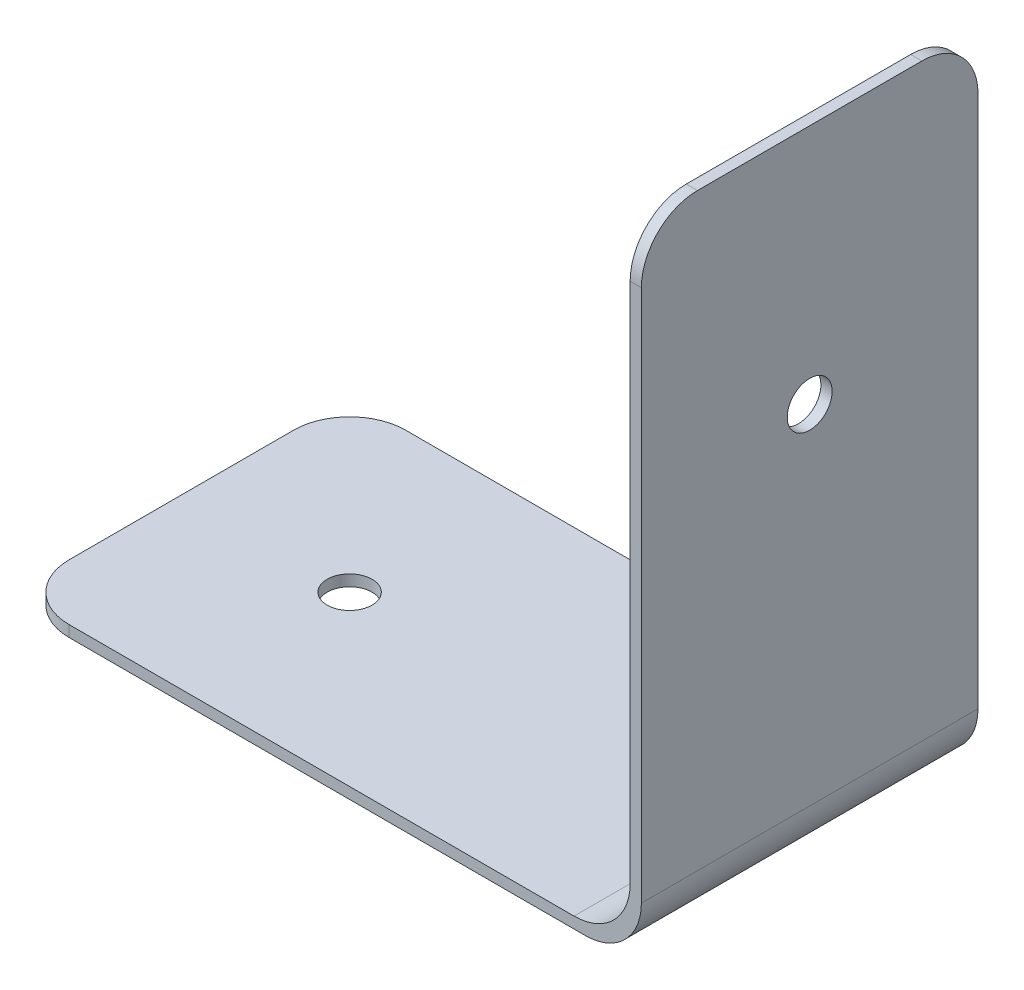
ISO-10303-21;
HEADER;
FILE_DESCRIPTION(('STEP AP214'),'2;1');
FILE_NAME('part.step','',(''),(''),'','','');
FILE_SCHEMA(('AUTOMOTIVE_DESIGN { 1 0 10303 214 1 1 1 1 }'));
ENDSEC;
DATA;
#1=APPLICATION_CONTEXT('core data for automotive mechanical design processes');
#2=APPLICATION_PROTOCOL_DEFINITION('international standard','automotive_design',2000,#1);
#3=PRODUCT_CONTEXT('',#1,'mechanical');
#4=PRODUCT('Part','Part','',(#3));
#5=PRODUCT_RELATED_PRODUCT_CATEGORY('part','',(#4));
#6=PRODUCT_DEFINITION_FORMATION('','',#4);
#7=PRODUCT_DEFINITION_CONTEXT('part definition',#1,'design');
#8=PRODUCT_DEFINITION('design','',#6,#7);
#9=PRODUCT_DEFINITION_SHAPE('','',#8);
#10=(LENGTH_UNIT() NAMED_UNIT(*) SI_UNIT(.MILLI.,.METRE.));
#11=(NAMED_UNIT(*) PLANE_ANGLE_UNIT() SI_UNIT($,.RADIAN.));
#12=(NAMED_UNIT(*) SI_UNIT($,.STERADIAN.) SOLID_ANGLE_UNIT());
#13=UNCERTAINTY_MEASURE_WITH_UNIT(LENGTH_MEASURE(1.E-05),#10,'distance_accuracy_value','');
#14=(GEOMETRIC_REPRESENTATION_CONTEXT(3) GLOBAL_UNCERTAINTY_ASSIGNED_CONTEXT((#13)) GLOBAL_UNIT_ASSIGNED_CONTEXT((#10,
#11,#12)) REPRESENTATION_CONTEXT('',''));
#15=CARTESIAN_POINT('',(0.,0.,0.));
#16=DIRECTION('',(0.,0.,1.));
#17=DIRECTION('',(1.,0.,0.));
#18=AXIS2_PLACEMENT_3D('',#15,#16,#17);
#19=CARTESIAN_POINT('',(0.,0.,60.));
#20=DIRECTION('',(1.,0.,0.));
#21=DIRECTION('',(0.,0.,-1.));
#22=AXIS2_PLACEMENT_3D('',#19,#20,#21);
#23=PLANE('',#22);
#24=DIRECTION('',(0.,0.,-1.));
#25=VECTOR('',#24,1.);
#26=CARTESIAN_POINT('',(0.,2.,60.));
#27=LINE('',#26,#25);
#28=CARTESIAN_POINT('',(0.,2.,50.));
#29=VERTEX_POINT('',#28);
#30=CARTESIAN_POINT('',(0.,2.,10.));
#31=VERTEX_POINT('',#30);
#32=EDGE_CURVE('E162',#29,#31,#27,.T.);
#33=ORIENTED_EDGE('',*,*,#32,.T.);
#34=DIRECTION('',(0.,-1.,0.));
#35=VECTOR('',#34,1.);
#36=CARTESIAN_POINT('',(0.,0.,10.));
#37=LINE('',#36,#35);
#38=CARTESIAN_POINT('',(0.,0.,10.));
#39=VERTEX_POINT('',#38);
#40=EDGE_CURVE('E211',#31,#39,#37,.T.);
#41=ORIENTED_EDGE('',*,*,#40,.T.);
#42=DIRECTION('',(0.,0.,-1.));
#43=VECTOR('',#42,1.);
#44=CARTESIAN_POINT('',(0.,0.,60.));
#45=LINE('',#44,#43);
#46=CARTESIAN_POINT('',(0.,0.,50.));
#47=VERTEX_POINT('',#46);
#48=EDGE_CURVE('E145',#47,#39,#45,.T.);
#49=ORIENTED_EDGE('',*,*,#48,.F.);
#50=DIRECTION('',(0.,-1.,0.));
#51=VECTOR('',#50,1.);
#52=CARTESIAN_POINT('',(0.,2.,50.));
#53=LINE('',#52,#51);
#54=EDGE_CURVE('E209',#47,#29,#53,.F.);
#55=ORIENTED_EDGE('',*,*,#54,.T.);
#56=EDGE_LOOP('',(#33,#41,#49,#55));
#57=FACE_BOUND('',#56,.T.);
#58=ADVANCED_FACE('F35',(#57),#23,.F.);
#59=CARTESIAN_POINT('',(0.,0.,60.));
#60=DIRECTION('',(0.,1.,0.));
#61=DIRECTION('',(-1.,0.,0.));
#62=AXIS2_PLACEMENT_3D('',#59,#60,#61);
#63=PLANE('',#62);
#64=CARTESIAN_POINT('',(30.,0.,30.));
#65=DIRECTION('',(0.,1.,0.));
#66=DIRECTION('',(-1.,0.,0.));
#67=AXIS2_PLACEMENT_3D('',#64,#65,#66);
#68=CIRCLE('',#67,4.00000000000001);
#69=CARTESIAN_POINT('',(26.,0.,30.));
#70=VERTEX_POINT('',#69);
#71=EDGE_CURVE('E165',#70,#70,#68,.T.);
#72=ORIENTED_EDGE('',*,*,#71,.T.);
#73=EDGE_LOOP('',(#72));
#74=FACE_BOUND('',#73,.T.);
#75=ORIENTED_EDGE('',*,*,#48,.T.);
#76=CARTESIAN_POINT('',(10.,0.,10.));
#77=DIRECTION('',(0.,1.,0.));
#78=DIRECTION('',(-1.,0.,0.));
#79=AXIS2_PLACEMENT_3D('',#76,#77,#78);
#80=CIRCLE('',#79,10.);
#81=CARTESIAN_POINT('',(10.,0.,0.));
#82=VERTEX_POINT('',#81);
#83=EDGE_CURVE('E216',#39,#82,#80,.F.);
#84=ORIENTED_EDGE('',*,*,#83,.T.);
#85=DIRECTION('',(1.,0.,0.));
#86=VECTOR('',#85,1.);
#87=CARTESIAN_POINT('',(0.,0.,0.));
#88=LINE('',#87,#86);
#89=CARTESIAN_POINT('',(102.,0.,0.));
#90=VERTEX_POINT('',#89);
#91=EDGE_CURVE('E142',#82,#90,#88,.T.);
#92=ORIENTED_EDGE('',*,*,#91,.T.);
#93=DIRECTION('',(0.,0.,-1.));
#94=VECTOR('',#93,1.);
#95=CARTESIAN_POINT('',(102.,0.,60.));
#96=LINE('',#95,#94);
#97=CARTESIAN_POINT('',(102.,0.,60.));
#98=VERTEX_POINT('',#97);
#99=EDGE_CURVE('E139',#98,#90,#96,.T.);
#100=ORIENTED_EDGE('',*,*,#99,.F.);
#101=DIRECTION('',(1.,0.,0.));
#102=VECTOR('',#101,1.);
#103=CARTESIAN_POINT('',(0.,0.,60.));
#104=LINE('',#103,#102);
#105=CARTESIAN_POINT('',(9.99999999999999,0.,60.));
#106=VERTEX_POINT('',#105);
#107=EDGE_CURVE('E127',#106,#98,#104,.T.);
#108=ORIENTED_EDGE('',*,*,#107,.F.);
#109=CARTESIAN_POINT('',(9.99999999999999,0.,50.));
#110=DIRECTION('',(0.,1.,0.));
#111=DIRECTION('',(-1.,0.,0.));
#112=AXIS2_PLACEMENT_3D('',#109,#110,#111);
#113=CIRCLE('',#112,10.);
#114=EDGE_CURVE('E214',#106,#47,#113,.F.);
#115=ORIENTED_EDGE('',*,*,#114,.T.);
#116=EDGE_LOOP('',(#75,#84,#92,#100,#108,#115));
#117=FACE_BOUND('',#116,.T.);
#118=ADVANCED_FACE('F141',(#74,#117),#63,.F.);
#119=CARTESIAN_POINT('',(102.,10.,60.));
#120=DIRECTION('',(0.,0.,-1.));
#121=DIRECTION('',(-1.,0.,0.));
#122=AXIS2_PLACEMENT_3D('',#119,#120,#121);
#123=CYLINDRICAL_SURFACE('',#122,9.99999999999999);
#124=CARTESIAN_POINT('',(102.,10.,0.));
#125=DIRECTION('',(0.,0.,1.));
#126=DIRECTION('',(1.,0.,0.));
#127=AXIS2_PLACEMENT_3D('',#124,#125,#126);
#128=CIRCLE('',#127,9.99999999999999);
#129=CARTESIAN_POINT('',(112.,10.,0.));
#130=VERTEX_POINT('',#129);
#131=EDGE_CURVE('E164',#90,#130,#128,.T.);
#132=ORIENTED_EDGE('',*,*,#131,.T.);
#133=DIRECTION('',(0.,0.,-1.));
#134=VECTOR('',#133,1.);
#135=CARTESIAN_POINT('',(112.,10.,60.));
#136=LINE('',#135,#134);
#137=CARTESIAN_POINT('',(112.,10.,60.));
#138=VERTEX_POINT('',#137);
#139=EDGE_CURVE('E146',#138,#130,#136,.T.);
#140=ORIENTED_EDGE('',*,*,#139,.F.);
#141=CARTESIAN_POINT('',(102.,10.,60.));
#142=DIRECTION('',(0.,0.,1.));
#143=DIRECTION('',(1.,0.,0.));
#144=AXIS2_PLACEMENT_3D('',#141,#142,#143);
#145=CIRCLE('',#144,9.99999999999999);
#146=EDGE_CURVE('E132',#98,#138,#145,.T.);
#147=ORIENTED_EDGE('',*,*,#146,.F.);
#148=ORIENTED_EDGE('',*,*,#99,.T.);
#149=EDGE_LOOP('',(#132,#140,#147,#148));
#150=FACE_BOUND('',#149,.T.);
#151=ADVANCED_FACE('F148',(#150),#123,.T.);
#152=CARTESIAN_POINT('',(112.,10.,60.));
#153=DIRECTION('',(-1.,0.,0.));
#154=DIRECTION('',(0.,0.,1.));
#155=AXIS2_PLACEMENT_3D('',#152,#153,#154);
#156=PLANE('',#155);
#157=CARTESIAN_POINT('',(112.,72.,30.));
#158=DIRECTION('',(-1.,0.,0.));
#159=DIRECTION('',(0.,-1.,0.));
#160=AXIS2_PLACEMENT_3D('',#157,#158,#159);
#161=CIRCLE('',#160,4.00000000000001);
#162=CARTESIAN_POINT('',(112.,68.,30.));
#163=VERTEX_POINT('',#162);
#164=EDGE_CURVE('E385',#163,#163,#161,.T.);
#165=ORIENTED_EDGE('',*,*,#164,.T.);
#166=EDGE_LOOP('',(#165));
#167=FACE_BOUND('',#166,.T.);
#168=DIRECTION('',(0.,1.,0.));
#169=VECTOR('',#168,1.);
#170=CARTESIAN_POINT('',(112.,10.,0.));
#171=LINE('',#170,#169);
#172=CARTESIAN_POINT('',(112.,105.,0.));
#173=VERTEX_POINT('',#172);
#174=EDGE_CURVE('E167',#130,#173,#171,.T.);
#175=ORIENTED_EDGE('',*,*,#174,.T.);
#176=CARTESIAN_POINT('',(112.,105.,10.));
#177=DIRECTION('',(-1.,0.,0.));
#178=DIRECTION('',(0.,0.,1.));
#179=AXIS2_PLACEMENT_3D('',#176,#177,#178);
#180=CIRCLE('',#179,10.);
#181=CARTESIAN_POINT('',(112.,115.,10.));
#182=VERTEX_POINT('',#181);
#183=EDGE_CURVE('E204',#173,#182,#180,.F.);
#184=ORIENTED_EDGE('',*,*,#183,.T.);
#185=DIRECTION('',(0.,0.,-1.));
#186=VECTOR('',#185,1.);
#187=CARTESIAN_POINT('',(112.,115.,60.));
#188=LINE('',#187,#186);
#189=CARTESIAN_POINT('',(112.,115.,50.));
#190=VERTEX_POINT('',#189);
#191=EDGE_CURVE('E186',#190,#182,#188,.T.);
#192=ORIENTED_EDGE('',*,*,#191,.F.);
#193=CARTESIAN_POINT('',(112.,105.,50.));
#194=DIRECTION('',(-1.,0.,0.));
#195=DIRECTION('',(0.,0.,1.));
#196=AXIS2_PLACEMENT_3D('',#193,#194,#195);
#197=CIRCLE('',#196,10.);
#198=CARTESIAN_POINT('',(112.,105.,60.));
#199=VERTEX_POINT('',#198);
#200=EDGE_CURVE('E202',#190,#199,#197,.F.);
#201=ORIENTED_EDGE('',*,*,#200,.T.);
#202=DIRECTION('',(0.,1.,0.));
#203=VECTOR('',#202,1.);
#204=CARTESIAN_POINT('',(112.,10.,60.));
#205=LINE('',#204,#203);
#206=EDGE_CURVE('E151',#138,#199,#205,.T.);
#207=ORIENTED_EDGE('',*,*,#206,.F.);
#208=ORIENTED_EDGE('',*,*,#139,.T.);
#209=EDGE_LOOP('',(#175,#184,#192,#201,#207,#208));
#210=FACE_BOUND('',#209,.T.);
#211=ADVANCED_FACE('F230',(#167,#210),#156,.F.);
#212=CARTESIAN_POINT('',(112.,115.,60.));
#213=DIRECTION('',(0.,-1.,0.));
#214=DIRECTION('',(0.,0.,-1.));
#215=AXIS2_PLACEMENT_3D('',#212,#213,#214);
#216=PLANE('',#215);
#217=ORIENTED_EDGE('',*,*,#191,.T.);
#218=DIRECTION('',(-1.,0.,0.));
#219=VECTOR('',#218,1.);
#220=CARTESIAN_POINT('',(112.,115.,10.));
#221=LINE('',#220,#219);
#222=CARTESIAN_POINT('',(110.,115.,10.));
#223=VERTEX_POINT('',#222);
#224=EDGE_CURVE('E193',#182,#223,#221,.T.);
#225=ORIENTED_EDGE('',*,*,#224,.T.);
#226=DIRECTION('',(0.,0.,-1.));
#227=VECTOR('',#226,1.);
#228=CARTESIAN_POINT('',(110.,115.,60.));
#229=LINE('',#228,#227);
#230=CARTESIAN_POINT('',(110.,115.,50.));
#231=VERTEX_POINT('',#230);
#232=EDGE_CURVE('E183',#231,#223,#229,.T.);
#233=ORIENTED_EDGE('',*,*,#232,.F.);
#234=DIRECTION('',(-1.,0.,0.));
#235=VECTOR('',#234,1.);
#236=CARTESIAN_POINT('',(112.,115.,50.));
#237=LINE('',#236,#235);
#238=EDGE_CURVE('E191',#231,#190,#237,.F.);
#239=ORIENTED_EDGE('',*,*,#238,.T.);
#240=EDGE_LOOP('',(#217,#225,#233,#239));
#241=FACE_BOUND('',#240,.T.);
#242=ADVANCED_FACE('F244',(#241),#216,.F.);
#243=CARTESIAN_POINT('',(110.,115.,60.));
#244=DIRECTION('',(1.,0.,0.));
#245=DIRECTION('',(0.,1.,0.));
#246=AXIS2_PLACEMENT_3D('',#243,#244,#245);
#247=PLANE('',#246);
#248=CARTESIAN_POINT('',(110.,72.,30.));
#249=DIRECTION('',(-1.,0.,0.));
#250=DIRECTION('',(0.,-1.,0.));
#251=AXIS2_PLACEMENT_3D('',#248,#249,#250);
#252=CIRCLE('',#251,4.00000000000001);
#253=CARTESIAN_POINT('',(110.,68.,30.));
#254=VERTEX_POINT('',#253);
#255=EDGE_CURVE('E388',#254,#254,#252,.T.);
#256=ORIENTED_EDGE('',*,*,#255,.F.);
#257=EDGE_LOOP('',(#256));
#258=FACE_BOUND('',#257,.T.);
#259=ORIENTED_EDGE('',*,*,#232,.T.);
#260=CARTESIAN_POINT('',(110.,105.,10.));
#261=DIRECTION('',(1.,0.,0.));
#262=DIRECTION('',(0.,1.,0.));
#263=AXIS2_PLACEMENT_3D('',#260,#261,#262);
#264=CIRCLE('',#263,10.);
#265=CARTESIAN_POINT('',(110.,105.,0.));
#266=VERTEX_POINT('',#265);
#267=EDGE_CURVE('E198',#223,#266,#264,.F.);
#268=ORIENTED_EDGE('',*,*,#267,.T.);
#269=DIRECTION('',(0.,-1.,0.));
#270=VECTOR('',#269,1.);
#271=CARTESIAN_POINT('',(110.,115.,0.));
#272=LINE('',#271,#270);
#273=CARTESIAN_POINT('',(110.,12.,0.));
#274=VERTEX_POINT('',#273);
#275=EDGE_CURVE('E170',#266,#274,#272,.T.);
#276=ORIENTED_EDGE('',*,*,#275,.T.);
#277=DIRECTION('',(0.,0.,-1.));
#278=VECTOR('',#277,1.);
#279=CARTESIAN_POINT('',(110.,12.,60.));
#280=LINE('',#279,#278);
#281=CARTESIAN_POINT('',(110.,12.,60.));
#282=VERTEX_POINT('',#281);
#283=EDGE_CURVE('E180',#282,#274,#280,.T.);
#284=ORIENTED_EDGE('',*,*,#283,.F.);
#285=DIRECTION('',(0.,-1.,0.));
#286=VECTOR('',#285,1.);
#287=CARTESIAN_POINT('',(110.,115.,60.));
#288=LINE('',#287,#286);
#289=CARTESIAN_POINT('',(110.,105.,60.));
#290=VERTEX_POINT('',#289);
#291=EDGE_CURVE('E153',#290,#282,#288,.T.);
#292=ORIENTED_EDGE('',*,*,#291,.F.);
#293=CARTESIAN_POINT('',(110.,105.,50.));
#294=DIRECTION('',(1.,0.,0.));
#295=DIRECTION('',(0.,1.,0.));
#296=AXIS2_PLACEMENT_3D('',#293,#294,#295);
#297=CIRCLE('',#296,10.);
#298=EDGE_CURVE('E196',#290,#231,#297,.F.);
#299=ORIENTED_EDGE('',*,*,#298,.T.);
#300=EDGE_LOOP('',(#259,#268,#276,#284,#292,#299));
#301=FACE_BOUND('',#300,.T.);
#302=ADVANCED_FACE('F241',(#258,#301),#247,.F.);
#303=CARTESIAN_POINT('',(100.,12.,60.));
#304=DIRECTION('',(0.,0.,-1.));
#305=DIRECTION('',(-1.,0.,0.));
#306=AXIS2_PLACEMENT_3D('',#303,#304,#305);
#307=CYLINDRICAL_SURFACE('',#306,10.);
#308=CARTESIAN_POINT('',(100.,12.,0.));
#309=DIRECTION('',(0.,0.,-1.));
#310=DIRECTION('',(1.,0.,0.));
#311=AXIS2_PLACEMENT_3D('',#308,#309,#310);
#312=CIRCLE('',#311,10.);
#313=CARTESIAN_POINT('',(100.,2.,0.));
#314=VERTEX_POINT('',#313);
#315=EDGE_CURVE('E172',#274,#314,#312,.T.);
#316=ORIENTED_EDGE('',*,*,#315,.T.);
#317=DIRECTION('',(0.,0.,-1.));
#318=VECTOR('',#317,1.);
#319=CARTESIAN_POINT('',(100.,2.,60.));
#320=LINE('',#319,#318);
#321=CARTESIAN_POINT('',(100.,2.,60.));
#322=VERTEX_POINT('',#321);
#323=EDGE_CURVE('E177',#322,#314,#320,.T.);
#324=ORIENTED_EDGE('',*,*,#323,.F.);
#325=CARTESIAN_POINT('',(100.,12.,60.));
#326=DIRECTION('',(0.,0.,-1.));
#327=DIRECTION('',(1.,0.,0.));
#328=AXIS2_PLACEMENT_3D('',#325,#326,#327);
#329=CIRCLE('',#328,10.);
#330=EDGE_CURVE('E158',#282,#322,#329,.T.);
#331=ORIENTED_EDGE('',*,*,#330,.F.);
#332=ORIENTED_EDGE('',*,*,#283,.T.);
#333=EDGE_LOOP('',(#316,#324,#331,#332));
#334=FACE_BOUND('',#333,.T.);
#335=ADVANCED_FACE('F253',(#334),#307,.F.);
#336=CARTESIAN_POINT('',(0.,2.,60.));
#337=DIRECTION('',(0.,-1.,0.));
#338=DIRECTION('',(1.,0.,0.));
#339=AXIS2_PLACEMENT_3D('',#336,#337,#338);
#340=PLANE('',#339);
#341=CARTESIAN_POINT('',(30.,2.,30.));
#342=DIRECTION('',(0.,1.,0.));
#343=DIRECTION('',(-1.,0.,0.));
#344=AXIS2_PLACEMENT_3D('',#341,#342,#343);
#345=CIRCLE('',#344,4.00000000000001);
#346=CARTESIAN_POINT('',(26.,2.,30.));
#347=VERTEX_POINT('',#346);
#348=EDGE_CURVE('E390',#347,#347,#345,.T.);
#349=ORIENTED_EDGE('',*,*,#348,.F.);
#350=EDGE_LOOP('',(#349));
#351=FACE_BOUND('',#350,.T.);
#352=DIRECTION('',(-1.,0.,0.));
#353=VECTOR('',#352,1.);
#354=CARTESIAN_POINT('',(0.,2.,0.));
#355=LINE('',#354,#353);
#356=CARTESIAN_POINT('',(10.,2.,0.));
#357=VERTEX_POINT('',#356);
#358=EDGE_CURVE('E136',#314,#357,#355,.T.);
#359=ORIENTED_EDGE('',*,*,#358,.T.);
#360=CARTESIAN_POINT('',(10.,2.,10.));
#361=DIRECTION('',(0.,-1.,0.));
#362=DIRECTION('',(1.,0.,0.));
#363=AXIS2_PLACEMENT_3D('',#360,#361,#362);
#364=CIRCLE('',#363,10.);
#365=EDGE_CURVE('E43',#357,#31,#364,.F.);
#366=ORIENTED_EDGE('',*,*,#365,.T.);
#367=ORIENTED_EDGE('',*,*,#32,.F.);
#368=CARTESIAN_POINT('',(9.99999999999999,2.,50.));
#369=DIRECTION('',(0.,-1.,0.));
#370=DIRECTION('',(1.,0.,0.));
#371=AXIS2_PLACEMENT_3D('',#368,#369,#370);
#372=CIRCLE('',#371,10.);
#373=CARTESIAN_POINT('',(9.99999999999999,2.,60.));
#374=VERTEX_POINT('',#373);
#375=EDGE_CURVE('E50',#29,#374,#372,.F.);
#376=ORIENTED_EDGE('',*,*,#375,.T.);
#377=DIRECTION('',(-1.,0.,0.));
#378=VECTOR('',#377,1.);
#379=CARTESIAN_POINT('',(0.,2.,60.));
#380=LINE('',#379,#378);
#381=EDGE_CURVE('E160',#322,#374,#380,.T.);
#382=ORIENTED_EDGE('',*,*,#381,.F.);
#383=ORIENTED_EDGE('',*,*,#323,.T.);
#384=EDGE_LOOP('',(#359,#366,#367,#376,#382,#383));
#385=FACE_BOUND('',#384,.T.);
#386=ADVANCED_FACE('F220',(#351,#385),#340,.F.);
#387=CARTESIAN_POINT('',(100.,12.,60.));
#388=DIRECTION('',(0.,0.,1.));
#389=DIRECTION('',(1.,0.,0.));
#390=AXIS2_PLACEMENT_3D('',#387,#388,#389);
#391=PLANE('',#390);
#392=ORIENTED_EDGE('',*,*,#381,.T.);
#393=DIRECTION('',(0.,-1.,0.));
#394=VECTOR('',#393,1.);
#395=CARTESIAN_POINT('',(9.99999999999999,0.,60.));
#396=LINE('',#395,#394);
#397=EDGE_CURVE('E11',#374,#106,#396,.T.);
#398=ORIENTED_EDGE('',*,*,#397,.T.);
#399=ORIENTED_EDGE('',*,*,#107,.T.);
#400=ORIENTED_EDGE('',*,*,#146,.T.);
#401=ORIENTED_EDGE('',*,*,#206,.T.);
#402=DIRECTION('',(-1.,0.,0.));
#403=VECTOR('',#402,1.);
#404=CARTESIAN_POINT('',(110.,105.,60.));
#405=LINE('',#404,#403);
#406=EDGE_CURVE('E206',#199,#290,#405,.T.);
#407=ORIENTED_EDGE('',*,*,#406,.T.);
#408=ORIENTED_EDGE('',*,*,#291,.T.);
#409=ORIENTED_EDGE('',*,*,#330,.T.);
#410=EDGE_LOOP('',(#392,#398,#399,#400,#401,#407,#408,#409));
#411=FACE_BOUND('',#410,.T.);
#412=ADVANCED_FACE('F129',(#411),#391,.T.);
#413=CARTESIAN_POINT('',(100.,12.,0.));
#414=DIRECTION('',(0.,0.,1.));
#415=DIRECTION('',(1.,0.,0.));
#416=AXIS2_PLACEMENT_3D('',#413,#414,#415);
#417=PLANE('',#416);
#418=ORIENTED_EDGE('',*,*,#91,.F.);
#419=DIRECTION('',(0.,-1.,0.));
#420=VECTOR('',#419,1.);
#421=CARTESIAN_POINT('',(9.99999999999999,12.,0.));
#422=LINE('',#421,#420);
#423=EDGE_CURVE('E58',#82,#357,#422,.F.);
#424=ORIENTED_EDGE('',*,*,#423,.T.);
#425=ORIENTED_EDGE('',*,*,#358,.F.);
#426=ORIENTED_EDGE('',*,*,#315,.F.);
#427=ORIENTED_EDGE('',*,*,#275,.F.);
#428=DIRECTION('',(-1.,0.,0.));
#429=VECTOR('',#428,1.);
#430=CARTESIAN_POINT('',(100.,105.,0.));
#431=LINE('',#430,#429);
#432=EDGE_CURVE('E200',#266,#173,#431,.F.);
#433=ORIENTED_EDGE('',*,*,#432,.T.);
#434=ORIENTED_EDGE('',*,*,#174,.F.);
#435=ORIENTED_EDGE('',*,*,#131,.F.);
#436=EDGE_LOOP('',(#418,#424,#425,#426,#427,#433,#434,#435));
#437=FACE_BOUND('',#436,.T.);
#438=ADVANCED_FACE('F227',(#437),#417,.F.);
#439=CARTESIAN_POINT('',(30.,0.,30.));
#440=DIRECTION('',(0.,1.,0.));
#441=DIRECTION('',(-1.,0.,0.));
#442=AXIS2_PLACEMENT_3D('',#439,#440,#441);
#443=CYLINDRICAL_SURFACE('',#442,4.00000000000001);
#444=ORIENTED_EDGE('',*,*,#71,.F.);
#445=EDGE_LOOP('',(#444));
#446=FACE_BOUND('',#445,.T.);
#447=ORIENTED_EDGE('',*,*,#348,.T.);
#448=EDGE_LOOP('',(#447));
#449=FACE_BOUND('',#448,.T.);
#450=ADVANCED_FACE('F295',(#446,#449),#443,.F.);
#451=CARTESIAN_POINT('',(112.,72.,30.));
#452=DIRECTION('',(-1.,0.,0.));
#453=DIRECTION('',(0.,-1.,0.));
#454=AXIS2_PLACEMENT_3D('',#451,#452,#453);
#455=CYLINDRICAL_SURFACE('',#454,4.00000000000001);
#456=ORIENTED_EDGE('',*,*,#164,.F.);
#457=EDGE_LOOP('',(#456));
#458=FACE_BOUND('',#457,.T.);
#459=ORIENTED_EDGE('',*,*,#255,.T.);
#460=EDGE_LOOP('',(#459));
#461=FACE_BOUND('',#460,.T.);
#462=ADVANCED_FACE('F271',(#458,#461),#455,.F.);
#463=CARTESIAN_POINT('',(112.,105.,10.));
#464=DIRECTION('',(-1.,0.,0.));
#465=DIRECTION('',(0.,0.,1.));
#466=AXIS2_PLACEMENT_3D('',#463,#464,#465);
#467=CYLINDRICAL_SURFACE('',#466,10.);
#468=ORIENTED_EDGE('',*,*,#183,.F.);
#469=ORIENTED_EDGE('',*,*,#432,.F.);
#470=ORIENTED_EDGE('',*,*,#267,.F.);
#471=ORIENTED_EDGE('',*,*,#224,.F.);
#472=EDGE_LOOP('',(#468,#469,#470,#471));
#473=FACE_BOUND('',#472,.T.);
#474=ADVANCED_FACE('F247',(#473),#467,.T.);
#475=CARTESIAN_POINT('',(100.,105.,50.));
#476=DIRECTION('',(1.,0.,0.));
#477=DIRECTION('',(0.,0.,-1.));
#478=AXIS2_PLACEMENT_3D('',#475,#476,#477);
#479=CYLINDRICAL_SURFACE('',#478,10.);
#480=ORIENTED_EDGE('',*,*,#200,.F.);
#481=ORIENTED_EDGE('',*,*,#238,.F.);
#482=ORIENTED_EDGE('',*,*,#298,.F.);
#483=ORIENTED_EDGE('',*,*,#406,.F.);
#484=EDGE_LOOP('',(#480,#481,#482,#483));
#485=FACE_BOUND('',#484,.T.);
#486=ADVANCED_FACE('F237',(#485),#479,.T.);
#487=CARTESIAN_POINT('',(10.,0.,10.));
#488=DIRECTION('',(0.,-1.,0.));
#489=DIRECTION('',(0.,0.,-1.));
#490=AXIS2_PLACEMENT_3D('',#487,#488,#489);
#491=CYLINDRICAL_SURFACE('',#490,10.);
#492=ORIENTED_EDGE('',*,*,#365,.F.);
#493=ORIENTED_EDGE('',*,*,#423,.F.);
#494=ORIENTED_EDGE('',*,*,#83,.F.);
#495=ORIENTED_EDGE('',*,*,#40,.F.);
#496=EDGE_LOOP('',(#492,#493,#494,#495));
#497=FACE_BOUND('',#496,.T.);
#498=ADVANCED_FACE('F226',(#497),#491,.T.);
#499=CARTESIAN_POINT('',(9.99999999999999,12.,50.));
#500=DIRECTION('',(0.,1.,0.));
#501=DIRECTION('',(0.,0.,1.));
#502=AXIS2_PLACEMENT_3D('',#499,#500,#501);
#503=CYLINDRICAL_SURFACE('',#502,10.);
#504=ORIENTED_EDGE('',*,*,#375,.F.);
#505=ORIENTED_EDGE('',*,*,#54,.F.);
#506=ORIENTED_EDGE('',*,*,#114,.F.);
#507=ORIENTED_EDGE('',*,*,#397,.F.);
#508=EDGE_LOOP('',(#504,#505,#506,#507));
#509=FACE_BOUND('',#508,.T.);
#510=ADVANCED_FACE('F37',(#509),#503,.T.);
#511=CLOSED_SHELL('',(#58,#118,#151,#211,#242,#302,#335,#386,#412,#438,#450,#462,#474,#486,#498,#510));
#512=MANIFOLD_SOLID_BREP('B2',#511);
#513=ADVANCED_BREP_SHAPE_REPRESENTATION('',(#18,#512),#14);
#514=SHAPE_DEFINITION_REPRESENTATION(#9,#513);
ENDSEC;
END-ISO-10303-21;
